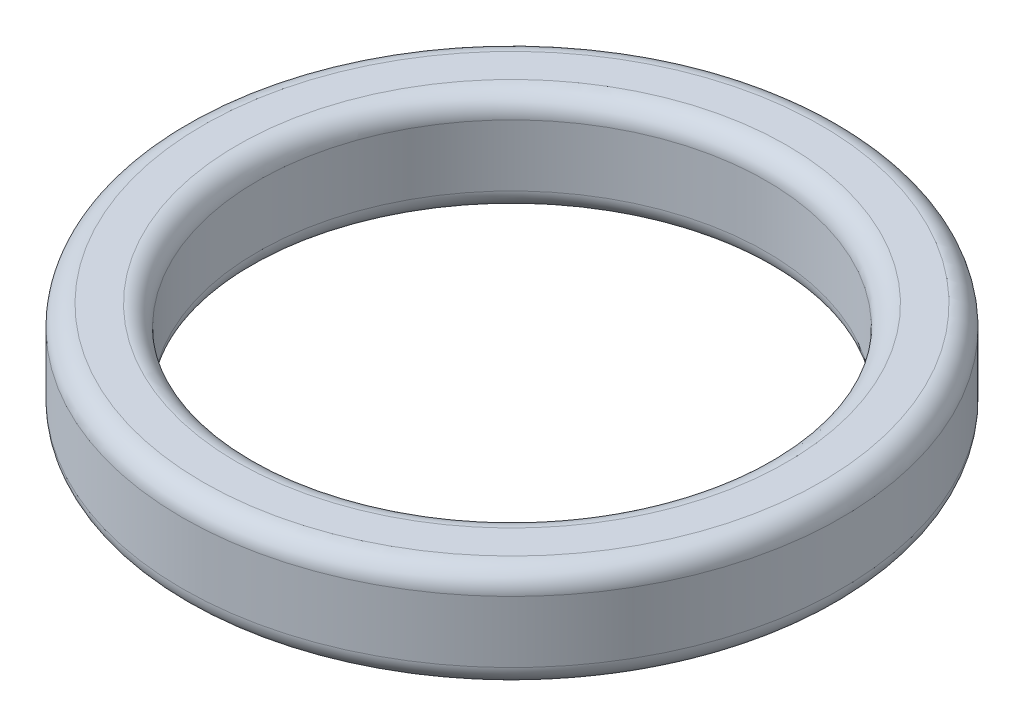
ISO-10303-21;
HEADER;
FILE_DESCRIPTION(('STEP AP214'),'2;1');
FILE_NAME('part.step','',(''),(''),'','','');
FILE_SCHEMA(('AUTOMOTIVE_DESIGN { 1 0 10303 214 1 1 1 1 }'));
ENDSEC;
DATA;
#1=APPLICATION_CONTEXT('core data for automotive mechanical design processes');
#2=APPLICATION_PROTOCOL_DEFINITION('international standard','automotive_design',2000,#1);
#3=PRODUCT_CONTEXT('',#1,'mechanical');
#4=PRODUCT('Part','Part','',(#3));
#5=PRODUCT_RELATED_PRODUCT_CATEGORY('part','',(#4));
#6=PRODUCT_DEFINITION_FORMATION('','',#4);
#7=PRODUCT_DEFINITION_CONTEXT('part definition',#1,'design');
#8=PRODUCT_DEFINITION('design','',#6,#7);
#9=PRODUCT_DEFINITION_SHAPE('','',#8);
#10=(LENGTH_UNIT() NAMED_UNIT(*) SI_UNIT(.MILLI.,.METRE.));
#11=(NAMED_UNIT(*) PLANE_ANGLE_UNIT() SI_UNIT($,.RADIAN.));
#12=(NAMED_UNIT(*) SI_UNIT($,.STERADIAN.) SOLID_ANGLE_UNIT());
#13=UNCERTAINTY_MEASURE_WITH_UNIT(LENGTH_MEASURE(1.E-05),#10,'distance_accuracy_value','');
#14=(GEOMETRIC_REPRESENTATION_CONTEXT(3) GLOBAL_UNCERTAINTY_ASSIGNED_CONTEXT((#13)) GLOBAL_UNIT_ASSIGNED_CONTEXT((#10,
#11,#12)) REPRESENTATION_CONTEXT('',''));
#15=CARTESIAN_POINT('',(0.,0.,0.));
#16=DIRECTION('',(0.,0.,1.));
#17=DIRECTION('',(1.,0.,0.));
#18=AXIS2_PLACEMENT_3D('',#15,#16,#17);
#19=CARTESIAN_POINT('',(0.,10.,0.));
#20=DIRECTION('',(0.,1.,0.));
#21=DIRECTION('',(0.,0.,1.));
#22=AXIS2_PLACEMENT_3D('',#19,#20,#21);
#23=PLANE('',#22);
#24=CARTESIAN_POINT('',(0.,10.,0.));
#25=DIRECTION('',(0.,1.,0.));
#26=DIRECTION('',(0.,0.,1.));
#27=AXIS2_PLACEMENT_3D('',#24,#25,#26);
#28=CIRCLE('',#27,26.7756930059431);
#29=CARTESIAN_POINT('',(0.,10.,26.7756930059431));
#30=VERTEX_POINT('',#29);
#31=EDGE_CURVE('E42',#30,#30,#28,.F.);
#32=ORIENTED_EDGE('',*,*,#31,.T.);
#33=EDGE_LOOP('',(#32));
#34=FACE_BOUND('',#33,.T.);
#35=CARTESIAN_POINT('',(0.,10.,0.));
#36=DIRECTION('',(0.,1.,0.));
#37=DIRECTION('',(0.,0.,1.));
#38=AXIS2_PLACEMENT_3D('',#35,#36,#37);
#39=CIRCLE('',#38,30.1220132974696);
#40=CARTESIAN_POINT('',(0.,10.,30.1220132974696));
#41=VERTEX_POINT('',#40);
#42=EDGE_CURVE('E46',#41,#41,#39,.T.);
#43=ORIENTED_EDGE('',*,*,#42,.T.);
#44=EDGE_LOOP('',(#43));
#45=FACE_BOUND('',#44,.T.);
#46=ADVANCED_FACE('F31',(#34,#45),#23,.T.);
#47=CARTESIAN_POINT('',(0.,0.,0.));
#48=DIRECTION('',(0.,1.,0.));
#49=DIRECTION('',(0.,0.,1.));
#50=AXIS2_PLACEMENT_3D('',#47,#48,#49);
#51=PLANE('',#50);
#52=CARTESIAN_POINT('',(0.,0.,0.));
#53=DIRECTION('',(0.,1.,0.));
#54=DIRECTION('',(0.,0.,1.));
#55=AXIS2_PLACEMENT_3D('',#52,#53,#54);
#56=CIRCLE('',#55,26.7756930059431);
#57=CARTESIAN_POINT('',(0.,0.,26.7756930059431));
#58=VERTEX_POINT('',#57);
#59=EDGE_CURVE('E57',#58,#58,#56,.T.);
#60=ORIENTED_EDGE('',*,*,#59,.T.);
#61=EDGE_LOOP('',(#60));
#62=FACE_BOUND('',#61,.T.);
#63=CARTESIAN_POINT('',(0.,0.,0.));
#64=DIRECTION('',(0.,1.,0.));
#65=DIRECTION('',(0.,0.,1.));
#66=AXIS2_PLACEMENT_3D('',#63,#64,#65);
#67=CIRCLE('',#66,30.1220132974696);
#68=CARTESIAN_POINT('',(0.,0.,30.1220132974696));
#69=VERTEX_POINT('',#68);
#70=EDGE_CURVE('E60',#69,#69,#67,.F.);
#71=ORIENTED_EDGE('',*,*,#70,.T.);
#72=EDGE_LOOP('',(#71));
#73=FACE_BOUND('',#72,.T.);
#74=ADVANCED_FACE('F64',(#62,#73),#51,.F.);
#75=CARTESIAN_POINT('',(0.,10.,0.));
#76=DIRECTION('',(0.,-1.,0.));
#77=DIRECTION('',(0.,0.,-1.));
#78=AXIS2_PLACEMENT_3D('',#75,#76,#77);
#79=CYLINDRICAL_SURFACE('',#78,32.1220132974696);
#80=CARTESIAN_POINT('',(0.,2.,0.));
#81=DIRECTION('',(0.,1.,0.));
#82=DIRECTION('',(0.,0.,1.));
#83=AXIS2_PLACEMENT_3D('',#80,#81,#82);
#84=CIRCLE('',#83,32.1220132974696);
#85=CARTESIAN_POINT('',(0.,2.,32.1220132974696));
#86=VERTEX_POINT('',#85);
#87=EDGE_CURVE('E10',#86,#86,#84,.T.);
#88=ORIENTED_EDGE('',*,*,#87,.T.);
#89=EDGE_LOOP('',(#88));
#90=FACE_BOUND('',#89,.T.);
#91=CARTESIAN_POINT('',(0.,8.,0.));
#92=DIRECTION('',(0.,1.,0.));
#93=DIRECTION('',(0.,0.,1.));
#94=AXIS2_PLACEMENT_3D('',#91,#92,#93);
#95=CIRCLE('',#94,32.1220132974696);
#96=CARTESIAN_POINT('',(0.,8.,32.1220132974696));
#97=VERTEX_POINT('',#96);
#98=EDGE_CURVE('E38',#97,#97,#95,.F.);
#99=ORIENTED_EDGE('',*,*,#98,.T.);
#100=EDGE_LOOP('',(#99));
#101=FACE_BOUND('',#100,.T.);
#102=ADVANCED_FACE('F84',(#90,#101),#79,.T.);
#103=CARTESIAN_POINT('',(0.,10.,0.));
#104=DIRECTION('',(0.,-1.,0.));
#105=DIRECTION('',(0.,0.,-1.));
#106=AXIS2_PLACEMENT_3D('',#103,#104,#105);
#107=CYLINDRICAL_SURFACE('',#106,24.7756930059431);
#108=CARTESIAN_POINT('',(0.,2.,0.));
#109=DIRECTION('',(0.,1.,0.));
#110=DIRECTION('',(0.,0.,1.));
#111=AXIS2_PLACEMENT_3D('',#108,#109,#110);
#112=CIRCLE('',#111,24.7756930059431);
#113=CARTESIAN_POINT('',(0.,2.,24.7756930059431));
#114=VERTEX_POINT('',#113);
#115=EDGE_CURVE('E51',#114,#114,#112,.F.);
#116=ORIENTED_EDGE('',*,*,#115,.T.);
#117=EDGE_LOOP('',(#116));
#118=FACE_BOUND('',#117,.T.);
#119=CARTESIAN_POINT('',(0.,8.,0.));
#120=DIRECTION('',(0.,1.,0.));
#121=DIRECTION('',(0.,0.,1.));
#122=AXIS2_PLACEMENT_3D('',#119,#120,#121);
#123=CIRCLE('',#122,24.7756930059431);
#124=CARTESIAN_POINT('',(0.,8.,24.7756930059431));
#125=VERTEX_POINT('',#124);
#126=EDGE_CURVE('E54',#125,#125,#123,.T.);
#127=ORIENTED_EDGE('',*,*,#126,.T.);
#128=EDGE_LOOP('',(#127));
#129=FACE_BOUND('',#128,.T.);
#130=ADVANCED_FACE('F89',(#118,#129),#107,.F.);
#131=CARTESIAN_POINT('',(0.,2.,0.));
#132=DIRECTION('',(0.,1.,0.));
#133=DIRECTION('',(0.,0.,1.));
#134=AXIS2_PLACEMENT_3D('',#131,#132,#133);
#135=TOROIDAL_SURFACE('',#134,26.7756930059431,2.);
#136=ORIENTED_EDGE('',*,*,#115,.F.);
#137=EDGE_LOOP('',(#136));
#138=FACE_BOUND('',#137,.T.);
#139=ORIENTED_EDGE('',*,*,#59,.F.);
#140=EDGE_LOOP('',(#139));
#141=FACE_BOUND('',#140,.T.);
#142=ADVANCED_FACE('F75',(#138,#141),#135,.T.);
#143=CARTESIAN_POINT('',(0.,8.,0.));
#144=DIRECTION('',(0.,1.,0.));
#145=DIRECTION('',(0.,0.,1.));
#146=AXIS2_PLACEMENT_3D('',#143,#144,#145);
#147=TOROIDAL_SURFACE('',#146,26.7756930059431,2.);
#148=ORIENTED_EDGE('',*,*,#31,.F.);
#149=EDGE_LOOP('',(#148));
#150=FACE_BOUND('',#149,.T.);
#151=ORIENTED_EDGE('',*,*,#126,.F.);
#152=EDGE_LOOP('',(#151));
#153=FACE_BOUND('',#152,.T.);
#154=ADVANCED_FACE('F69',(#150,#153),#147,.T.);
#155=CARTESIAN_POINT('',(0.,2.,0.));
#156=DIRECTION('',(0.,1.,0.));
#157=DIRECTION('',(0.,0.,1.));
#158=AXIS2_PLACEMENT_3D('',#155,#156,#157);
#159=TOROIDAL_SURFACE('',#158,30.1220132974696,2.);
#160=ORIENTED_EDGE('',*,*,#70,.F.);
#161=EDGE_LOOP('',(#160));
#162=FACE_BOUND('',#161,.T.);
#163=ORIENTED_EDGE('',*,*,#87,.F.);
#164=EDGE_LOOP('',(#163));
#165=FACE_BOUND('',#164,.T.);
#166=ADVANCED_FACE('F66',(#162,#165),#159,.T.);
#167=CARTESIAN_POINT('',(0.,8.,0.));
#168=DIRECTION('',(0.,1.,0.));
#169=DIRECTION('',(0.,0.,1.));
#170=AXIS2_PLACEMENT_3D('',#167,#168,#169);
#171=TOROIDAL_SURFACE('',#170,30.1220132974696,2.);
#172=ORIENTED_EDGE('',*,*,#98,.F.);
#173=EDGE_LOOP('',(#172));
#174=FACE_BOUND('',#173,.T.);
#175=ORIENTED_EDGE('',*,*,#42,.F.);
#176=EDGE_LOOP('',(#175));
#177=FACE_BOUND('',#176,.T.);
#178=ADVANCED_FACE('F33',(#174,#177),#171,.T.);
#179=CLOSED_SHELL('',(#46,#74,#102,#130,#142,#154,#166,#178));
#180=MANIFOLD_SOLID_BREP('B2',#179);
#181=ADVANCED_BREP_SHAPE_REPRESENTATION('',(#18,#180),#14);
#182=SHAPE_DEFINITION_REPRESENTATION(#9,#181);
ENDSEC;
END-ISO-10303-21;
